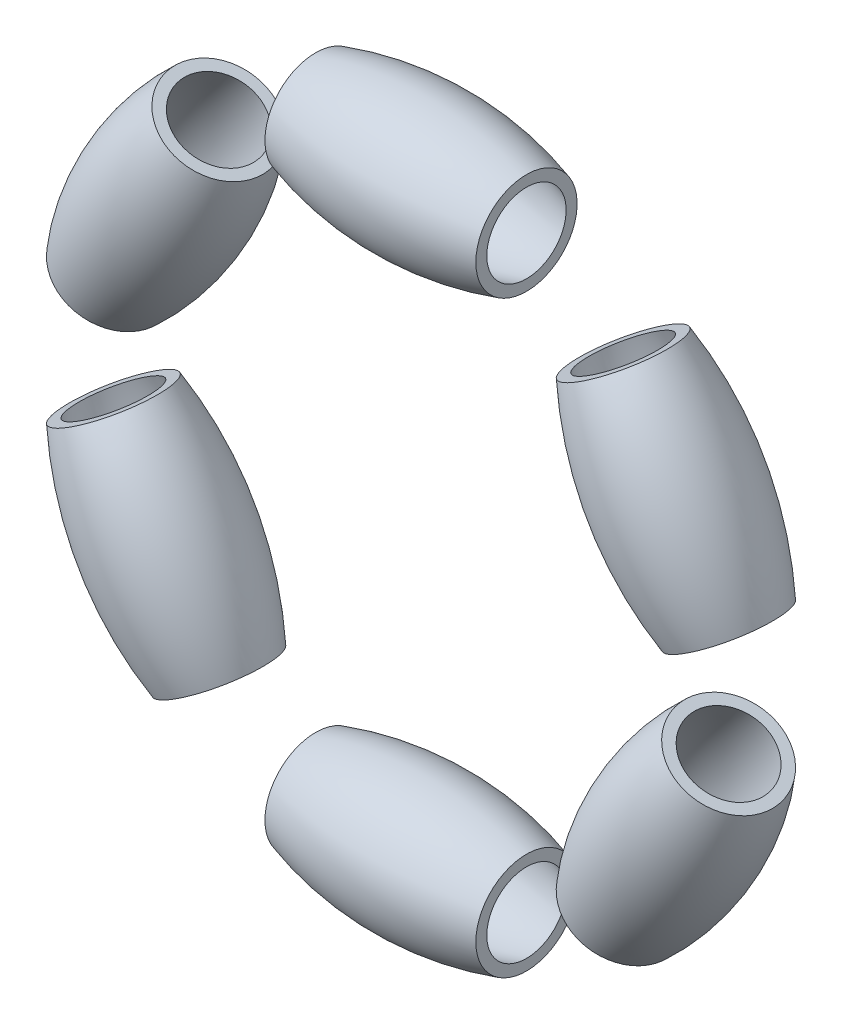
ISO-10303-21;
HEADER;
FILE_DESCRIPTION(('STEP AP214'),'2;1');
FILE_NAME('part.step','',(''),(''),'','','');
FILE_SCHEMA(('AUTOMOTIVE_DESIGN { 1 0 10303 214 1 1 1 1 }'));
ENDSEC;
DATA;
#1=APPLICATION_CONTEXT('core data for automotive mechanical design processes');
#2=APPLICATION_PROTOCOL_DEFINITION('international standard','automotive_design',2000,#1);
#3=PRODUCT_CONTEXT('',#1,'mechanical');
#4=PRODUCT('Part','Part','',(#3));
#5=PRODUCT_RELATED_PRODUCT_CATEGORY('part','',(#4));
#6=PRODUCT_DEFINITION_FORMATION('','',#4);
#7=PRODUCT_DEFINITION_CONTEXT('part definition',#1,'design');
#8=PRODUCT_DEFINITION('design','',#6,#7);
#9=PRODUCT_DEFINITION_SHAPE('','',#8);
#10=(LENGTH_UNIT() NAMED_UNIT(*) SI_UNIT(.MILLI.,.METRE.));
#11=(NAMED_UNIT(*) PLANE_ANGLE_UNIT() SI_UNIT($,.RADIAN.));
#12=(NAMED_UNIT(*) SI_UNIT($,.STERADIAN.) SOLID_ANGLE_UNIT());
#13=UNCERTAINTY_MEASURE_WITH_UNIT(LENGTH_MEASURE(1.E-05),#10,'distance_accuracy_value','');
#14=(GEOMETRIC_REPRESENTATION_CONTEXT(3) GLOBAL_UNCERTAINTY_ASSIGNED_CONTEXT((#13)) GLOBAL_UNIT_ASSIGNED_CONTEXT((#10,
#11,#12)) REPRESENTATION_CONTEXT('',''));
#15=CARTESIAN_POINT('',(0.,0.,0.));
#16=DIRECTION('',(0.,0.,1.));
#17=DIRECTION('',(1.,0.,0.));
#18=AXIS2_PLACEMENT_3D('',#15,#16,#17);
#19=CARTESIAN_POINT('',(48.7572302330636,28.1500000000006,0.));
#20=DIRECTION('',(-0.50000000000001,0.866025403784433,0.));
#21=DIRECTION('',(0.,0.,1.));
#22=AXIS2_PLACEMENT_3D('',#19,#20,#21);
#23=DEGENERATE_TOROIDAL_SURFACE('',#22,56.3,67.,.F.);
#24=CARTESIAN_POINT('',(58.844054045998,10.679108669003,0.));
#25=DIRECTION('',(-0.50000000000001,0.866025403784433,0.));
#26=DIRECTION('',(0.,0.,1.));
#27=AXIS2_PLACEMENT_3D('',#24,#25,#26);
#28=CIRCLE('',#27,7.5907187427665);
#29=CARTESIAN_POINT('',(58.844054045998,10.679108669003,7.5907187427665));
#30=VERTEX_POINT('',#29);
#31=EDGE_CURVE('E11',#30,#30,#28,.T.);
#32=ORIENTED_EDGE('',*,*,#31,.F.);
#33=EDGE_LOOP('',(#32));
#34=FACE_BOUND('',#33,.T.);
#35=CARTESIAN_POINT('',(38.6704064201292,45.6208913309981,0.));
#36=DIRECTION('',(-0.50000000000001,0.866025403784433,0.));
#37=DIRECTION('',(0.,0.,1.));
#38=AXIS2_PLACEMENT_3D('',#35,#36,#37);
#39=CIRCLE('',#38,7.59071874276652);
#40=CARTESIAN_POINT('',(38.6704064201292,45.6208913309981,7.59071874276652));
#41=VERTEX_POINT('',#40);
#42=EDGE_CURVE('E55',#41,#41,#39,.T.);
#43=ORIENTED_EDGE('',*,*,#42,.T.);
#44=EDGE_LOOP('',(#43));
#45=FACE_BOUND('',#44,.T.);
#46=ADVANCED_FACE('F41',(#34,#45),#23,.T.);
#47=CARTESIAN_POINT('',(67.2315344701809,15.5216227497279,0.));
#48=DIRECTION('',(-0.50000000000001,0.866025403784433,0.));
#49=DIRECTION('',(0.,0.,1.));
#50=AXIS2_PLACEMENT_3D('',#47,#48,#49);
#51=PLANE('',#50);
#52=CARTESIAN_POINT('',(58.844054045998,10.679108669003,0.));
#53=DIRECTION('',(-0.50000000000001,0.866025403784433,0.));
#54=DIRECTION('',(0.,0.,1.));
#55=AXIS2_PLACEMENT_3D('',#52,#53,#54);
#56=CIRCLE('',#55,9.6850281614496);
#57=CARTESIAN_POINT('',(58.844054045998,10.679108669003,9.6850281614496));
#58=VERTEX_POINT('',#57);
#59=EDGE_CURVE('E47',#58,#58,#56,.T.);
#60=ORIENTED_EDGE('',*,*,#59,.F.);
#61=EDGE_LOOP('',(#60));
#62=FACE_BOUND('',#61,.T.);
#63=ORIENTED_EDGE('',*,*,#31,.T.);
#64=EDGE_LOOP('',(#63));
#65=FACE_BOUND('',#64,.T.);
#66=ADVANCED_FACE('F70',(#62,#65),#51,.F.);
#67=CARTESIAN_POINT('',(48.7572302330636,28.1500000000006,0.));
#68=DIRECTION('',(-0.50000000000001,0.866025403784433,0.));
#69=DIRECTION('',(0.,0.,1.));
#70=AXIS2_PLACEMENT_3D('',#67,#68,#69);
#71=DEGENERATE_TOROIDAL_SURFACE('',#70,56.3,69.,.F.);
#72=CARTESIAN_POINT('',(38.6704064201292,45.6208913309981,0.));
#73=DIRECTION('',(-0.50000000000001,0.866025403784433,0.));
#74=DIRECTION('',(0.,0.,1.));
#75=AXIS2_PLACEMENT_3D('',#72,#73,#74);
#76=CIRCLE('',#75,9.6850281614496);
#77=CARTESIAN_POINT('',(38.6704064201292,45.6208913309981,9.6850281614496));
#78=VERTEX_POINT('',#77);
#79=EDGE_CURVE('E51',#78,#78,#76,.T.);
#80=ORIENTED_EDGE('',*,*,#79,.F.);
#81=EDGE_LOOP('',(#80));
#82=FACE_BOUND('',#81,.T.);
#83=ORIENTED_EDGE('',*,*,#59,.T.);
#84=EDGE_LOOP('',(#83));
#85=FACE_BOUND('',#84,.T.);
#86=ADVANCED_FACE('F65',(#82,#85),#71,.F.);
#87=CARTESIAN_POINT('',(47.0578868443122,50.463405411723,0.));
#88=DIRECTION('',(0.50000000000001,-0.866025403784433,0.));
#89=DIRECTION('',(0.,0.,-1.));
#90=AXIS2_PLACEMENT_3D('',#87,#88,#89);
#91=PLANE('',#90);
#92=ORIENTED_EDGE('',*,*,#42,.F.);
#93=EDGE_LOOP('',(#92));
#94=FACE_BOUND('',#93,.T.);
#95=ORIENTED_EDGE('',*,*,#79,.T.);
#96=EDGE_LOOP('',(#95));
#97=FACE_BOUND('',#96,.T.);
#98=ADVANCED_FACE('F62',(#94,#97),#91,.F.);
#99=CLOSED_SHELL('',(#46,#66,#86,#98));
#100=MANIFOLD_SOLID_BREP('B2',#99);
#101=CARTESIAN_POINT('',(48.7572302330641,-28.1499999999995,0.));
#102=DIRECTION('',(0.499999999999992,0.866025403784443,0.));
#103=DIRECTION('',(0.,0.,1.));
#104=AXIS2_PLACEMENT_3D('',#101,#102,#103);
#105=DEGENERATE_TOROIDAL_SURFACE('',#104,56.3,67.,.F.);
#106=CARTESIAN_POINT('',(38.6704064201301,-45.6208913309973,0.));
#107=DIRECTION('',(0.499999999999992,0.866025403784443,0.));
#108=DIRECTION('',(0.,0.,1.));
#109=AXIS2_PLACEMENT_3D('',#106,#107,#108);
#110=CIRCLE('',#109,7.5907187427665);
#111=CARTESIAN_POINT('',(38.6704064201301,-45.6208913309973,7.5907187427665));
#112=VERTEX_POINT('',#111);
#113=EDGE_CURVE('E40',#112,#112,#110,.T.);
#114=ORIENTED_EDGE('',*,*,#113,.F.);
#115=EDGE_LOOP('',(#114));
#116=FACE_BOUND('',#115,.T.);
#117=CARTESIAN_POINT('',(58.8440540459982,-10.6791086690018,0.));
#118=DIRECTION('',(0.499999999999992,0.866025403784443,0.));
#119=DIRECTION('',(0.,0.,1.));
#120=AXIS2_PLACEMENT_3D('',#117,#118,#119);
#121=CIRCLE('',#120,7.59071874276652);
#122=CARTESIAN_POINT('',(58.8440540459982,-10.6791086690018,7.59071874276652));
#123=VERTEX_POINT('',#122);
#124=EDGE_CURVE('E124',#123,#123,#121,.T.);
#125=ORIENTED_EDGE('',*,*,#124,.T.);
#126=EDGE_LOOP('',(#125));
#127=FACE_BOUND('',#126,.T.);
#128=ADVANCED_FACE('F110',(#116,#127),#105,.T.);
#129=CARTESIAN_POINT('',(47.0578868443132,-50.463405411722,0.));
#130=DIRECTION('',(0.499999999999992,0.866025403784443,0.));
#131=DIRECTION('',(0.,0.,1.));
#132=AXIS2_PLACEMENT_3D('',#129,#130,#131);
#133=PLANE('',#132);
#134=CARTESIAN_POINT('',(38.6704064201301,-45.6208913309973,0.));
#135=DIRECTION('',(0.499999999999992,0.866025403784443,0.));
#136=DIRECTION('',(0.,0.,1.));
#137=AXIS2_PLACEMENT_3D('',#134,#135,#136);
#138=CIRCLE('',#137,9.6850281614496);
#139=CARTESIAN_POINT('',(38.6704064201301,-45.6208913309973,9.6850281614496));
#140=VERTEX_POINT('',#139);
#141=EDGE_CURVE('E116',#140,#140,#138,.T.);
#142=ORIENTED_EDGE('',*,*,#141,.F.);
#143=EDGE_LOOP('',(#142));
#144=FACE_BOUND('',#143,.T.);
#145=ORIENTED_EDGE('',*,*,#113,.T.);
#146=EDGE_LOOP('',(#145));
#147=FACE_BOUND('',#146,.T.);
#148=ADVANCED_FACE('F139',(#144,#147),#133,.F.);
#149=CARTESIAN_POINT('',(48.7572302330641,-28.1499999999995,0.));
#150=DIRECTION('',(0.499999999999992,0.866025403784443,0.));
#151=DIRECTION('',(0.,0.,1.));
#152=AXIS2_PLACEMENT_3D('',#149,#150,#151);
#153=DEGENERATE_TOROIDAL_SURFACE('',#152,56.3,69.,.F.);
#154=CARTESIAN_POINT('',(58.8440540459982,-10.6791086690018,0.));
#155=DIRECTION('',(0.499999999999992,0.866025403784443,0.));
#156=DIRECTION('',(0.,0.,1.));
#157=AXIS2_PLACEMENT_3D('',#154,#155,#156);
#158=CIRCLE('',#157,9.6850281614496);
#159=CARTESIAN_POINT('',(58.8440540459982,-10.6791086690018,9.6850281614496));
#160=VERTEX_POINT('',#159);
#161=EDGE_CURVE('E120',#160,#160,#158,.T.);
#162=ORIENTED_EDGE('',*,*,#161,.F.);
#163=EDGE_LOOP('',(#162));
#164=FACE_BOUND('',#163,.T.);
#165=ORIENTED_EDGE('',*,*,#141,.T.);
#166=EDGE_LOOP('',(#165));
#167=FACE_BOUND('',#166,.T.);
#168=ADVANCED_FACE('F134',(#164,#167),#153,.F.);
#169=CARTESIAN_POINT('',(67.2315344701813,-15.5216227497265,0.));
#170=DIRECTION('',(-0.499999999999992,-0.866025403784443,0.));
#171=DIRECTION('',(0.,0.,-1.));
#172=AXIS2_PLACEMENT_3D('',#169,#170,#171);
#173=PLANE('',#172);
#174=ORIENTED_EDGE('',*,*,#124,.F.);
#175=EDGE_LOOP('',(#174));
#176=FACE_BOUND('',#175,.T.);
#177=ORIENTED_EDGE('',*,*,#161,.T.);
#178=EDGE_LOOP('',(#177));
#179=FACE_BOUND('',#178,.T.);
#180=ADVANCED_FACE('F131',(#176,#179),#173,.F.);
#181=CLOSED_SHELL('',(#128,#148,#168,#180));
#182=MANIFOLD_SOLID_BREP('B6',#181);
#183=CARTESIAN_POINT('',(0.,-56.3,0.));
#184=DIRECTION('',(1.,0.,0.));
#185=DIRECTION('',(0.,0.,1.));
#186=AXIS2_PLACEMENT_3D('',#183,#184,#185);
#187=DEGENERATE_TOROIDAL_SURFACE('',#186,56.3,67.,.F.);
#188=CARTESIAN_POINT('',(-20.1736476258684,-56.3,0.));
#189=DIRECTION('',(1.,0.,0.));
#190=DIRECTION('',(0.,0.,1.));
#191=AXIS2_PLACEMENT_3D('',#188,#189,#190);
#192=CIRCLE('',#191,7.5907187427665);
#193=CARTESIAN_POINT('',(-20.1736476258684,-56.3,7.5907187427665));
#194=VERTEX_POINT('',#193);
#195=EDGE_CURVE('E109',#194,#194,#192,.T.);
#196=ORIENTED_EDGE('',*,*,#195,.F.);
#197=EDGE_LOOP('',(#196));
#198=FACE_BOUND('',#197,.T.);
#199=CARTESIAN_POINT('',(20.1736476258684,-56.3,0.));
#200=DIRECTION('',(1.,0.,0.));
#201=DIRECTION('',(0.,0.,1.));
#202=AXIS2_PLACEMENT_3D('',#199,#200,#201);
#203=CIRCLE('',#202,7.59071874276652);
#204=CARTESIAN_POINT('',(20.1736476258684,-56.3,7.59071874276652));
#205=VERTEX_POINT('',#204);
#206=EDGE_CURVE('E193',#205,#205,#203,.T.);
#207=ORIENTED_EDGE('',*,*,#206,.T.);
#208=EDGE_LOOP('',(#207));
#209=FACE_BOUND('',#208,.T.);
#210=ADVANCED_FACE('F179',(#198,#209),#187,.T.);
#211=CARTESIAN_POINT('',(-20.1736476258684,-65.9850281614496,0.));
#212=DIRECTION('',(1.,0.,0.));
#213=DIRECTION('',(0.,0.,1.));
#214=AXIS2_PLACEMENT_3D('',#211,#212,#213);
#215=PLANE('',#214);
#216=CARTESIAN_POINT('',(-20.1736476258684,-56.3,0.));
#217=DIRECTION('',(1.,0.,0.));
#218=DIRECTION('',(0.,0.,1.));
#219=AXIS2_PLACEMENT_3D('',#216,#217,#218);
#220=CIRCLE('',#219,9.6850281614496);
#221=CARTESIAN_POINT('',(-20.1736476258684,-56.3,9.6850281614496));
#222=VERTEX_POINT('',#221);
#223=EDGE_CURVE('E185',#222,#222,#220,.T.);
#224=ORIENTED_EDGE('',*,*,#223,.F.);
#225=EDGE_LOOP('',(#224));
#226=FACE_BOUND('',#225,.T.);
#227=ORIENTED_EDGE('',*,*,#195,.T.);
#228=EDGE_LOOP('',(#227));
#229=FACE_BOUND('',#228,.T.);
#230=ADVANCED_FACE('F208',(#226,#229),#215,.F.);
#231=CARTESIAN_POINT('',(0.,-56.3,0.));
#232=DIRECTION('',(1.,0.,0.));
#233=DIRECTION('',(0.,0.,1.));
#234=AXIS2_PLACEMENT_3D('',#231,#232,#233);
#235=DEGENERATE_TOROIDAL_SURFACE('',#234,56.3,69.,.F.);
#236=CARTESIAN_POINT('',(20.1736476258684,-56.3,0.));
#237=DIRECTION('',(1.,0.,0.));
#238=DIRECTION('',(0.,0.,1.));
#239=AXIS2_PLACEMENT_3D('',#236,#237,#238);
#240=CIRCLE('',#239,9.6850281614496);
#241=CARTESIAN_POINT('',(20.1736476258684,-56.3,9.6850281614496));
#242=VERTEX_POINT('',#241);
#243=EDGE_CURVE('E189',#242,#242,#240,.T.);
#244=ORIENTED_EDGE('',*,*,#243,.F.);
#245=EDGE_LOOP('',(#244));
#246=FACE_BOUND('',#245,.T.);
#247=ORIENTED_EDGE('',*,*,#223,.T.);
#248=EDGE_LOOP('',(#247));
#249=FACE_BOUND('',#248,.T.);
#250=ADVANCED_FACE('F203',(#246,#249),#235,.F.);
#251=CARTESIAN_POINT('',(20.1736476258684,-65.9850281614496,0.));
#252=DIRECTION('',(-1.,0.,0.));
#253=DIRECTION('',(0.,0.,-1.));
#254=AXIS2_PLACEMENT_3D('',#251,#252,#253);
#255=PLANE('',#254);
#256=ORIENTED_EDGE('',*,*,#206,.F.);
#257=EDGE_LOOP('',(#256));
#258=FACE_BOUND('',#257,.T.);
#259=ORIENTED_EDGE('',*,*,#243,.T.);
#260=EDGE_LOOP('',(#259));
#261=FACE_BOUND('',#260,.T.);
#262=ADVANCED_FACE('F200',(#258,#261),#255,.F.);
#263=CLOSED_SHELL('',(#210,#230,#250,#262));
#264=MANIFOLD_SOLID_BREP('B35',#263);
#265=CARTESIAN_POINT('',(-48.7572302330638,-28.1500000000002,0.));
#266=DIRECTION('',(0.500000000000004,-0.866025403784436,0.));
#267=DIRECTION('',(0.,0.,1.));
#268=AXIS2_PLACEMENT_3D('',#265,#266,#267);
#269=DEGENERATE_TOROIDAL_SURFACE('',#268,56.3,67.,.F.);
#270=CARTESIAN_POINT('',(-58.844054045998,-10.6791086690026,0.));
#271=DIRECTION('',(0.500000000000004,-0.866025403784436,0.));
#272=DIRECTION('',(0.,0.,1.));
#273=AXIS2_PLACEMENT_3D('',#270,#271,#272);
#274=CIRCLE('',#273,7.5907187427665);
#275=CARTESIAN_POINT('',(-58.844054045998,-10.6791086690026,7.5907187427665));
#276=VERTEX_POINT('',#275);
#277=EDGE_CURVE('E178',#276,#276,#274,.T.);
#278=ORIENTED_EDGE('',*,*,#277,.F.);
#279=EDGE_LOOP('',(#278));
#280=FACE_BOUND('',#279,.T.);
#281=CARTESIAN_POINT('',(-38.6704064201295,-45.6208913309978,0.));
#282=DIRECTION('',(0.500000000000004,-0.866025403784436,0.));
#283=DIRECTION('',(0.,0.,1.));
#284=AXIS2_PLACEMENT_3D('',#281,#282,#283);
#285=CIRCLE('',#284,7.59071874276652);
#286=CARTESIAN_POINT('',(-38.6704064201295,-45.6208913309978,7.59071874276652));
#287=VERTEX_POINT('',#286);
#288=EDGE_CURVE('E262',#287,#287,#285,.T.);
#289=ORIENTED_EDGE('',*,*,#288,.T.);
#290=EDGE_LOOP('',(#289));
#291=FACE_BOUND('',#290,.T.);
#292=ADVANCED_FACE('F248',(#280,#291),#269,.T.);
#293=CARTESIAN_POINT('',(-67.2315344701811,-15.5216227497275,0.));
#294=DIRECTION('',(0.500000000000004,-0.866025403784436,0.));
#295=DIRECTION('',(0.,0.,1.));
#296=AXIS2_PLACEMENT_3D('',#293,#294,#295);
#297=PLANE('',#296);
#298=CARTESIAN_POINT('',(-58.844054045998,-10.6791086690026,0.));
#299=DIRECTION('',(0.500000000000004,-0.866025403784436,0.));
#300=DIRECTION('',(0.,0.,1.));
#301=AXIS2_PLACEMENT_3D('',#298,#299,#300);
#302=CIRCLE('',#301,9.6850281614496);
#303=CARTESIAN_POINT('',(-58.844054045998,-10.6791086690026,9.6850281614496));
#304=VERTEX_POINT('',#303);
#305=EDGE_CURVE('E254',#304,#304,#302,.T.);
#306=ORIENTED_EDGE('',*,*,#305,.F.);
#307=EDGE_LOOP('',(#306));
#308=FACE_BOUND('',#307,.T.);
#309=ORIENTED_EDGE('',*,*,#277,.T.);
#310=EDGE_LOOP('',(#309));
#311=FACE_BOUND('',#310,.T.);
#312=ADVANCED_FACE('F277',(#308,#311),#297,.F.);
#313=CARTESIAN_POINT('',(-48.7572302330638,-28.1500000000002,0.));
#314=DIRECTION('',(0.500000000000004,-0.866025403784436,0.));
#315=DIRECTION('',(0.,0.,1.));
#316=AXIS2_PLACEMENT_3D('',#313,#314,#315);
#317=DEGENERATE_TOROIDAL_SURFACE('',#316,56.3,69.,.F.);
#318=CARTESIAN_POINT('',(-38.6704064201295,-45.6208913309978,0.));
#319=DIRECTION('',(0.500000000000004,-0.866025403784436,0.));
#320=DIRECTION('',(0.,0.,1.));
#321=AXIS2_PLACEMENT_3D('',#318,#319,#320);
#322=CIRCLE('',#321,9.6850281614496);
#323=CARTESIAN_POINT('',(-38.6704064201295,-45.6208913309978,9.6850281614496));
#324=VERTEX_POINT('',#323);
#325=EDGE_CURVE('E258',#324,#324,#322,.T.);
#326=ORIENTED_EDGE('',*,*,#325,.F.);
#327=EDGE_LOOP('',(#326));
#328=FACE_BOUND('',#327,.T.);
#329=ORIENTED_EDGE('',*,*,#305,.T.);
#330=EDGE_LOOP('',(#329));
#331=FACE_BOUND('',#330,.T.);
#332=ADVANCED_FACE('F272',(#328,#331),#317,.F.);
#333=CARTESIAN_POINT('',(-47.0578868443125,-50.4634054117227,0.));
#334=DIRECTION('',(-0.500000000000004,0.866025403784436,0.));
#335=DIRECTION('',(0.,0.,-1.));
#336=AXIS2_PLACEMENT_3D('',#333,#334,#335);
#337=PLANE('',#336);
#338=ORIENTED_EDGE('',*,*,#288,.F.);
#339=EDGE_LOOP('',(#338));
#340=FACE_BOUND('',#339,.T.);
#341=ORIENTED_EDGE('',*,*,#325,.T.);
#342=EDGE_LOOP('',(#341));
#343=FACE_BOUND('',#342,.T.);
#344=ADVANCED_FACE('F269',(#340,#343),#337,.F.);
#345=CLOSED_SHELL('',(#292,#312,#332,#344));
#346=MANIFOLD_SOLID_BREP('B104',#345);
#347=CARTESIAN_POINT('',(-48.757230233064,28.1499999999999,0.));
#348=DIRECTION('',(-0.499999999999998,-0.86602540378444,0.));
#349=DIRECTION('',(0.,0.,1.));
#350=AXIS2_PLACEMENT_3D('',#347,#348,#349);
#351=DEGENERATE_TOROIDAL_SURFACE('',#350,56.3,67.,.F.);
#352=CARTESIAN_POINT('',(-38.6704064201298,45.6208913309976,0.));
#353=DIRECTION('',(-0.499999999999998,-0.86602540378444,0.));
#354=DIRECTION('',(0.,0.,1.));
#355=AXIS2_PLACEMENT_3D('',#352,#353,#354);
#356=CIRCLE('',#355,7.5907187427665);
#357=CARTESIAN_POINT('',(-38.6704064201298,45.6208913309976,7.5907187427665));
#358=VERTEX_POINT('',#357);
#359=EDGE_CURVE('E247',#358,#358,#356,.T.);
#360=ORIENTED_EDGE('',*,*,#359,.F.);
#361=EDGE_LOOP('',(#360));
#362=FACE_BOUND('',#361,.T.);
#363=CARTESIAN_POINT('',(-58.8440540459981,10.6791086690022,0.));
#364=DIRECTION('',(-0.499999999999998,-0.86602540378444,0.));
#365=DIRECTION('',(0.,0.,1.));
#366=AXIS2_PLACEMENT_3D('',#363,#364,#365);
#367=CIRCLE('',#366,7.59071874276652);
#368=CARTESIAN_POINT('',(-58.8440540459981,10.6791086690022,7.59071874276652));
#369=VERTEX_POINT('',#368);
#370=EDGE_CURVE('E330',#369,#369,#367,.T.);
#371=ORIENTED_EDGE('',*,*,#370,.T.);
#372=EDGE_LOOP('',(#371));
#373=FACE_BOUND('',#372,.T.);
#374=ADVANCED_FACE('F316',(#362,#373),#351,.T.);
#375=CARTESIAN_POINT('',(-47.0578868443129,50.4634054117223,0.));
#376=DIRECTION('',(-0.499999999999998,-0.86602540378444,0.));
#377=DIRECTION('',(0.,0.,1.));
#378=AXIS2_PLACEMENT_3D('',#375,#376,#377);
#379=PLANE('',#378);
#380=CARTESIAN_POINT('',(-38.6704064201298,45.6208913309976,0.));
#381=DIRECTION('',(-0.499999999999998,-0.86602540378444,0.));
#382=DIRECTION('',(0.,0.,1.));
#383=AXIS2_PLACEMENT_3D('',#380,#381,#382);
#384=CIRCLE('',#383,9.6850281614496);
#385=CARTESIAN_POINT('',(-38.6704064201298,45.6208913309976,9.6850281614496));
#386=VERTEX_POINT('',#385);
#387=EDGE_CURVE('E322',#386,#386,#384,.T.);
#388=ORIENTED_EDGE('',*,*,#387,.F.);
#389=EDGE_LOOP('',(#388));
#390=FACE_BOUND('',#389,.T.);
#391=ORIENTED_EDGE('',*,*,#359,.T.);
#392=EDGE_LOOP('',(#391));
#393=FACE_BOUND('',#392,.T.);
#394=ADVANCED_FACE('F345',(#390,#393),#379,.F.);
#395=CARTESIAN_POINT('',(-48.757230233064,28.1499999999999,0.));
#396=DIRECTION('',(-0.499999999999998,-0.86602540378444,0.));
#397=DIRECTION('',(0.,0.,1.));
#398=AXIS2_PLACEMENT_3D('',#395,#396,#397);
#399=DEGENERATE_TOROIDAL_SURFACE('',#398,56.3,69.,.F.);
#400=CARTESIAN_POINT('',(-58.8440540459981,10.6791086690022,0.));
#401=DIRECTION('',(-0.499999999999998,-0.86602540378444,0.));
#402=DIRECTION('',(0.,0.,1.));
#403=AXIS2_PLACEMENT_3D('',#400,#401,#402);
#404=CIRCLE('',#403,9.6850281614496);
#405=CARTESIAN_POINT('',(-58.8440540459981,10.6791086690022,9.6850281614496));
#406=VERTEX_POINT('',#405);
#407=EDGE_CURVE('E326',#406,#406,#404,.T.);
#408=ORIENTED_EDGE('',*,*,#407,.F.);
#409=EDGE_LOOP('',(#408));
#410=FACE_BOUND('',#409,.T.);
#411=ORIENTED_EDGE('',*,*,#387,.T.);
#412=EDGE_LOOP('',(#411));
#413=FACE_BOUND('',#412,.T.);
#414=ADVANCED_FACE('F340',(#410,#413),#399,.F.);
#415=CARTESIAN_POINT('',(-67.2315344701812,15.521622749727,0.));
#416=DIRECTION('',(0.499999999999998,0.86602540378444,0.));
#417=DIRECTION('',(0.,0.,-1.));
#418=AXIS2_PLACEMENT_3D('',#415,#416,#417);
#419=PLANE('',#418);
#420=ORIENTED_EDGE('',*,*,#370,.F.);
#421=EDGE_LOOP('',(#420));
#422=FACE_BOUND('',#421,.T.);
#423=ORIENTED_EDGE('',*,*,#407,.T.);
#424=EDGE_LOOP('',(#423));
#425=FACE_BOUND('',#424,.T.);
#426=ADVANCED_FACE('F337',(#422,#425),#419,.F.);
#427=CLOSED_SHELL('',(#374,#394,#414,#426));
#428=MANIFOLD_SOLID_BREP('B173',#427);
#429=CARTESIAN_POINT('',(0.,56.3,0.));
#430=DIRECTION('',(-1.,0.,0.));
#431=DIRECTION('',(0.,0.,1.));
#432=AXIS2_PLACEMENT_3D('',#429,#430,#431);
#433=DEGENERATE_TOROIDAL_SURFACE('',#432,56.3,67.,.F.);
#434=CARTESIAN_POINT('',(20.1736476258684,56.3,0.));
#435=DIRECTION('',(-1.,0.,0.));
#436=DIRECTION('',(0.,0.,1.));
#437=AXIS2_PLACEMENT_3D('',#434,#435,#436);
#438=CIRCLE('',#437,7.5907187427665);
#439=CARTESIAN_POINT('',(20.1736476258684,56.3,7.5907187427665));
#440=VERTEX_POINT('',#439);
#441=EDGE_CURVE('E315',#440,#440,#438,.T.);
#442=ORIENTED_EDGE('',*,*,#441,.F.);
#443=EDGE_LOOP('',(#442));
#444=FACE_BOUND('',#443,.T.);
#445=CARTESIAN_POINT('',(-20.1736476258684,56.3,0.));
#446=DIRECTION('',(-1.,0.,0.));
#447=DIRECTION('',(0.,0.,1.));
#448=AXIS2_PLACEMENT_3D('',#445,#446,#447);
#449=CIRCLE('',#448,7.59071874276652);
#450=CARTESIAN_POINT('',(-20.1736476258684,56.3,7.59071874276652));
#451=VERTEX_POINT('',#450);
#452=EDGE_CURVE('E391',#451,#451,#449,.T.);
#453=ORIENTED_EDGE('',*,*,#452,.T.);
#454=EDGE_LOOP('',(#453));
#455=FACE_BOUND('',#454,.T.);
#456=ADVANCED_FACE('F377',(#444,#455),#433,.T.);
#457=CARTESIAN_POINT('',(20.1736476258684,65.9850281614496,0.));
#458=DIRECTION('',(-1.,0.,0.));
#459=DIRECTION('',(0.,0.,1.));
#460=AXIS2_PLACEMENT_3D('',#457,#458,#459);
#461=PLANE('',#460);
#462=CARTESIAN_POINT('',(20.1736476258684,56.3,0.));
#463=DIRECTION('',(-1.,0.,0.));
#464=DIRECTION('',(0.,0.,1.));
#465=AXIS2_PLACEMENT_3D('',#462,#463,#464);
#466=CIRCLE('',#465,9.6850281614496);
#467=CARTESIAN_POINT('',(20.1736476258684,56.3,9.6850281614496));
#468=VERTEX_POINT('',#467);
#469=EDGE_CURVE('E383',#468,#468,#466,.T.);
#470=ORIENTED_EDGE('',*,*,#469,.F.);
#471=EDGE_LOOP('',(#470));
#472=FACE_BOUND('',#471,.T.);
#473=ORIENTED_EDGE('',*,*,#441,.T.);
#474=EDGE_LOOP('',(#473));
#475=FACE_BOUND('',#474,.T.);
#476=ADVANCED_FACE('F406',(#472,#475),#461,.F.);
#477=CARTESIAN_POINT('',(0.,56.3,0.));
#478=DIRECTION('',(-1.,0.,0.));
#479=DIRECTION('',(0.,0.,1.));
#480=AXIS2_PLACEMENT_3D('',#477,#478,#479);
#481=DEGENERATE_TOROIDAL_SURFACE('',#480,56.3,69.,.F.);
#482=CARTESIAN_POINT('',(-20.1736476258684,56.3,0.));
#483=DIRECTION('',(-1.,0.,0.));
#484=DIRECTION('',(0.,0.,1.));
#485=AXIS2_PLACEMENT_3D('',#482,#483,#484);
#486=CIRCLE('',#485,9.6850281614496);
#487=CARTESIAN_POINT('',(-20.1736476258684,56.3,9.6850281614496));
#488=VERTEX_POINT('',#487);
#489=EDGE_CURVE('E387',#488,#488,#486,.T.);
#490=ORIENTED_EDGE('',*,*,#489,.F.);
#491=EDGE_LOOP('',(#490));
#492=FACE_BOUND('',#491,.T.);
#493=ORIENTED_EDGE('',*,*,#469,.T.);
#494=EDGE_LOOP('',(#493));
#495=FACE_BOUND('',#494,.T.);
#496=ADVANCED_FACE('F401',(#492,#495),#481,.F.);
#497=CARTESIAN_POINT('',(-20.1736476258684,65.9850281614496,0.));
#498=DIRECTION('',(1.,0.,0.));
#499=DIRECTION('',(0.,0.,-1.));
#500=AXIS2_PLACEMENT_3D('',#497,#498,#499);
#501=PLANE('',#500);
#502=ORIENTED_EDGE('',*,*,#452,.F.);
#503=EDGE_LOOP('',(#502));
#504=FACE_BOUND('',#503,.T.);
#505=ORIENTED_EDGE('',*,*,#489,.T.);
#506=EDGE_LOOP('',(#505));
#507=FACE_BOUND('',#506,.T.);
#508=ADVANCED_FACE('F398',(#504,#507),#501,.F.);
#509=CLOSED_SHELL('',(#456,#476,#496,#508));
#510=MANIFOLD_SOLID_BREP('B242',#509);
#511=ADVANCED_BREP_SHAPE_REPRESENTATION('',(#18,#100,#182,#264,#346,#428,#510),#14);
#512=SHAPE_DEFINITION_REPRESENTATION(#9,#511);
ENDSEC;
END-ISO-10303-21;
